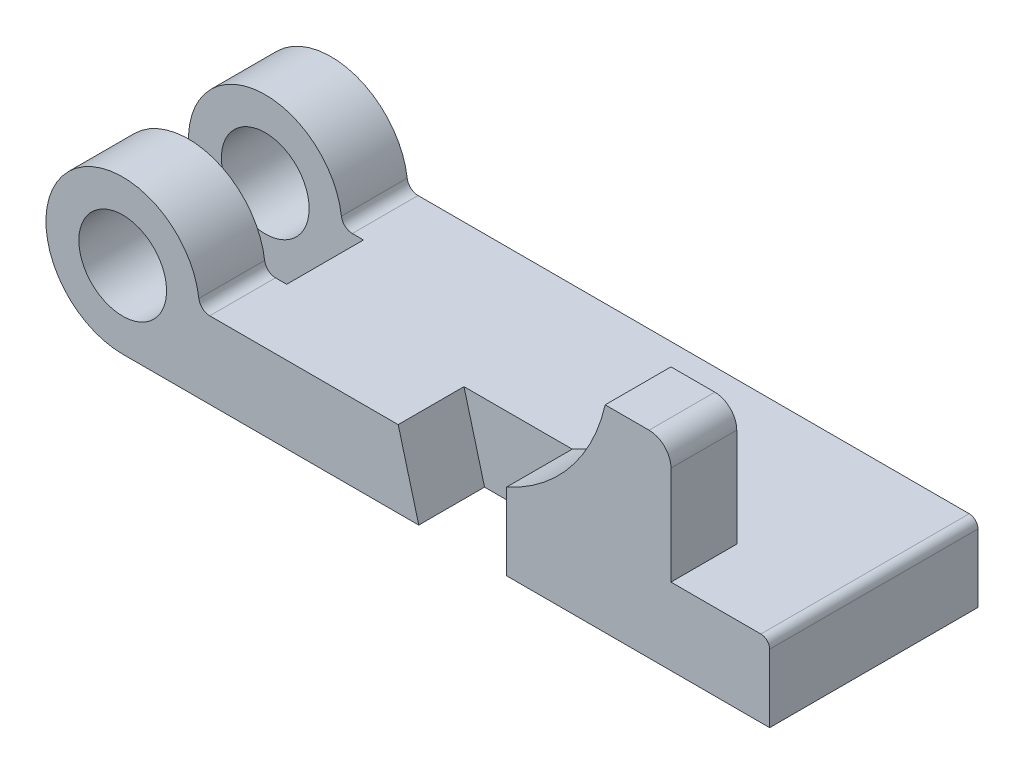
ISO-10303-21;
HEADER;
FILE_DESCRIPTION(('STEP AP214'),'2;1');
FILE_NAME('part.step','',(''),(''),'','','');
FILE_SCHEMA(('AUTOMOTIVE_DESIGN { 1 0 10303 214 1 1 1 1 }'));
ENDSEC;
DATA;
#1=APPLICATION_CONTEXT('core data for automotive mechanical design processes');
#2=APPLICATION_PROTOCOL_DEFINITION('international standard','automotive_design',2000,#1);
#3=PRODUCT_CONTEXT('',#1,'mechanical');
#4=PRODUCT('Part','Part','',(#3));
#5=PRODUCT_RELATED_PRODUCT_CATEGORY('part','',(#4));
#6=PRODUCT_DEFINITION_FORMATION('','',#4);
#7=PRODUCT_DEFINITION_CONTEXT('part definition',#1,'design');
#8=PRODUCT_DEFINITION('design','',#6,#7);
#9=PRODUCT_DEFINITION_SHAPE('','',#8);
#10=(LENGTH_UNIT() NAMED_UNIT(*) SI_UNIT(.MILLI.,.METRE.));
#11=(NAMED_UNIT(*) PLANE_ANGLE_UNIT() SI_UNIT($,.RADIAN.));
#12=(NAMED_UNIT(*) SI_UNIT($,.STERADIAN.) SOLID_ANGLE_UNIT());
#13=UNCERTAINTY_MEASURE_WITH_UNIT(LENGTH_MEASURE(1.E-05),#10,'distance_accuracy_value','');
#14=(GEOMETRIC_REPRESENTATION_CONTEXT(3) GLOBAL_UNCERTAINTY_ASSIGNED_CONTEXT((#13)) GLOBAL_UNIT_ASSIGNED_CONTEXT((#10,
#11,#12)) REPRESENTATION_CONTEXT('',''));
#15=CARTESIAN_POINT('',(0.,0.,0.));
#16=DIRECTION('',(0.,0.,1.));
#17=DIRECTION('',(1.,0.,0.));
#18=AXIS2_PLACEMENT_3D('',#15,#16,#17);
#19=CARTESIAN_POINT('',(0.,0.,11.1125));
#20=DIRECTION('',(0.,0.,1.));
#21=DIRECTION('',(1.,0.,0.));
#22=AXIS2_PLACEMENT_3D('',#19,#20,#21);
#23=PLANE('',#22);
#24=DIRECTION('',(1.,0.,0.));
#25=VECTOR('',#24,1.);
#26=CARTESIAN_POINT('',(0.,-22.225,11.1125));
#27=LINE('',#26,#25);
#28=CARTESIAN_POINT('',(85.725,-22.225,11.1125));
#29=VERTEX_POINT('',#28);
#30=CARTESIAN_POINT('',(111.125,-22.225,11.1125));
#31=VERTEX_POINT('',#30);
#32=EDGE_CURVE('E313',#29,#31,#27,.T.);
#33=ORIENTED_EDGE('',*,*,#32,.T.);
#34=DIRECTION('',(0.,-1.,0.));
#35=VECTOR('',#34,1.);
#36=CARTESIAN_POINT('',(111.125,0.,11.1125));
#37=LINE('',#36,#35);
#38=CARTESIAN_POINT('',(111.125,0.,11.1125));
#39=VERTEX_POINT('',#38);
#40=EDGE_CURVE('E53',#39,#31,#37,.T.);
#41=ORIENTED_EDGE('',*,*,#40,.F.);
#42=DIRECTION('',(-1.,0.,0.));
#43=VECTOR('',#42,1.);
#44=CARTESIAN_POINT('',(0.,0.,11.1125));
#45=LINE('',#44,#43);
#46=CARTESIAN_POINT('',(79.7698291982182,0.,11.1125));
#47=VERTEX_POINT('',#46);
#48=EDGE_CURVE('E315',#39,#47,#45,.T.);
#49=ORIENTED_EDGE('',*,*,#48,.T.);
#50=DIRECTION('',(-0.258819045102525,0.965925826289067,0.));
#51=VECTOR('',#50,1.);
#52=CARTESIAN_POINT('',(74.4262638697102,19.9424572995548,11.1125));
#53=LINE('',#52,#51);
#54=EDGE_CURVE('E305',#29,#47,#53,.T.);
#55=ORIENTED_EDGE('',*,*,#54,.F.);
#56=EDGE_LOOP('',(#33,#41,#49,#55));
#57=FACE_BOUND('',#56,.T.);
#58=ADVANCED_FACE('F35',(#57),#23,.T.);
#59=CARTESIAN_POINT('',(0.,-22.225,11.1125));
#60=DIRECTION('',(0.,1.,0.));
#61=DIRECTION('',(0.,0.,1.));
#62=AXIS2_PLACEMENT_3D('',#59,#60,#61);
#63=PLANE('',#62);
#64=DIRECTION('',(0.,0.,-1.));
#65=VECTOR('',#64,1.);
#66=CARTESIAN_POINT('',(41.275,-22.225,11.1125));
#67=LINE('',#66,#65);
#68=CARTESIAN_POINT('',(41.275,-22.225,11.1125));
#69=VERTEX_POINT('',#68);
#70=CARTESIAN_POINT('',(41.275,-22.225,-11.1125));
#71=VERTEX_POINT('',#70);
#72=EDGE_CURVE('E333',#69,#71,#67,.T.);
#73=ORIENTED_EDGE('',*,*,#72,.T.);
#74=DIRECTION('',(1.,0.,0.));
#75=VECTOR('',#74,1.);
#76=CARTESIAN_POINT('',(0.,-22.225,-11.1125));
#77=LINE('',#76,#75);
#78=CARTESIAN_POINT('',(0.,-22.225,-11.1125));
#79=VERTEX_POINT('',#78);
#80=EDGE_CURVE('E214',#79,#71,#77,.T.);
#81=ORIENTED_EDGE('',*,*,#80,.F.);
#82=DIRECTION('',(0.,0.,1.));
#83=VECTOR('',#82,1.);
#84=CARTESIAN_POINT('',(0.,-22.225,-30.1625));
#85=LINE('',#84,#83);
#86=CARTESIAN_POINT('',(0.,-22.225,-30.1625));
#87=VERTEX_POINT('',#86);
#88=EDGE_CURVE('E179',#87,#79,#85,.T.);
#89=ORIENTED_EDGE('',*,*,#88,.F.);
#90=DIRECTION('',(1.,0.,0.));
#91=VECTOR('',#90,1.);
#92=CARTESIAN_POINT('',(0.,-22.225,-30.1625));
#93=LINE('',#92,#91);
#94=CARTESIAN_POINT('',(187.325,-22.225,-30.1625));
#95=VERTEX_POINT('',#94);
#96=EDGE_CURVE('E197',#87,#95,#93,.T.);
#97=ORIENTED_EDGE('',*,*,#96,.T.);
#98=DIRECTION('',(0.,0.,-1.));
#99=VECTOR('',#98,1.);
#100=CARTESIAN_POINT('',(187.325,-22.225,11.1125));
#101=LINE('',#100,#99);
#102=CARTESIAN_POINT('',(187.325,-22.225,30.1625));
#103=VERTEX_POINT('',#102);
#104=EDGE_CURVE('E11',#103,#95,#101,.T.);
#105=ORIENTED_EDGE('',*,*,#104,.F.);
#106=DIRECTION('',(1.,0.,0.));
#107=VECTOR('',#106,1.);
#108=CARTESIAN_POINT('',(0.,-22.225,30.1625));
#109=LINE('',#108,#107);
#110=CARTESIAN_POINT('',(111.125,-22.225,30.1625));
#111=VERTEX_POINT('',#110);
#112=EDGE_CURVE('E244',#111,#103,#109,.T.);
#113=ORIENTED_EDGE('',*,*,#112,.F.);
#114=DIRECTION('',(0.,0.,-1.));
#115=VECTOR('',#114,1.);
#116=CARTESIAN_POINT('',(111.125,-22.225,30.1625));
#117=LINE('',#116,#115);
#118=EDGE_CURVE('E247',#111,#31,#117,.T.);
#119=ORIENTED_EDGE('',*,*,#118,.T.);
#120=ORIENTED_EDGE('',*,*,#32,.F.);
#121=DIRECTION('',(0.,0.,-1.));
#122=VECTOR('',#121,1.);
#123=CARTESIAN_POINT('',(85.725,-22.225,30.1625));
#124=LINE('',#123,#122);
#125=CARTESIAN_POINT('',(85.725,-22.225,30.1625));
#126=VERTEX_POINT('',#125);
#127=EDGE_CURVE('E320',#126,#29,#124,.T.);
#128=ORIENTED_EDGE('',*,*,#127,.F.);
#129=DIRECTION('',(1.,0.,0.));
#130=VECTOR('',#129,1.);
#131=CARTESIAN_POINT('',(0.,-22.225,30.1625));
#132=LINE('',#131,#130);
#133=CARTESIAN_POINT('',(0.,-22.225,30.1625));
#134=VERTEX_POINT('',#133);
#135=EDGE_CURVE('E281',#134,#126,#132,.T.);
#136=ORIENTED_EDGE('',*,*,#135,.F.);
#137=DIRECTION('',(0.,0.,-1.));
#138=VECTOR('',#137,1.);
#139=CARTESIAN_POINT('',(0.,-22.225,30.1625));
#140=LINE('',#139,#138);
#141=CARTESIAN_POINT('',(0.,-22.225,11.1125));
#142=VERTEX_POINT('',#141);
#143=EDGE_CURVE('E327',#134,#142,#140,.T.);
#144=ORIENTED_EDGE('',*,*,#143,.T.);
#145=DIRECTION('',(1.,0.,0.));
#146=VECTOR('',#145,1.);
#147=CARTESIAN_POINT('',(0.,-22.225,11.1125));
#148=LINE('',#147,#146);
#149=EDGE_CURVE('E296',#142,#69,#148,.T.);
#150=ORIENTED_EDGE('',*,*,#149,.T.);
#151=EDGE_LOOP('',(#73,#81,#89,#97,#105,#113,#119,#120,#128,#136,#144,#150));
#152=FACE_BOUND('',#151,.T.);
#153=ADVANCED_FACE('F37',(#152),#63,.F.);
#154=CARTESIAN_POINT('',(187.325,0.,11.1125));
#155=DIRECTION('',(-1.,0.,0.));
#156=DIRECTION('',(0.,0.,1.));
#157=AXIS2_PLACEMENT_3D('',#154,#155,#156);
#158=PLANE('',#157);
#159=ORIENTED_EDGE('',*,*,#104,.T.);
#160=DIRECTION('',(0.,1.,0.));
#161=VECTOR('',#160,1.);
#162=CARTESIAN_POINT('',(187.325,0.,-30.1625));
#163=LINE('',#162,#161);
#164=CARTESIAN_POINT('',(187.325,-2.54000000000002,-30.1625));
#165=VERTEX_POINT('',#164);
#166=EDGE_CURVE('E199',#95,#165,#163,.T.);
#167=ORIENTED_EDGE('',*,*,#166,.T.);
#168=DIRECTION('',(0.,0.,-1.));
#169=VECTOR('',#168,1.);
#170=CARTESIAN_POINT('',(187.325,-2.54000000000002,11.1125));
#171=LINE('',#170,#169);
#172=CARTESIAN_POINT('',(187.325,-2.54000000000002,30.1625));
#173=VERTEX_POINT('',#172);
#174=EDGE_CURVE('E45',#173,#165,#171,.T.);
#175=ORIENTED_EDGE('',*,*,#174,.F.);
#176=DIRECTION('',(0.,1.,0.));
#177=VECTOR('',#176,1.);
#178=CARTESIAN_POINT('',(187.325,0.,30.1625));
#179=LINE('',#178,#177);
#180=EDGE_CURVE('E225',#103,#173,#179,.T.);
#181=ORIENTED_EDGE('',*,*,#180,.F.);
#182=EDGE_LOOP('',(#159,#167,#175,#181));
#183=FACE_BOUND('',#182,.T.);
#184=ADVANCED_FACE('F346',(#183),#158,.F.);
#185=CARTESIAN_POINT('',(184.785,-2.54,11.1125));
#186=DIRECTION('',(0.,0.,-1.));
#187=DIRECTION('',(-1.,0.,0.));
#188=AXIS2_PLACEMENT_3D('',#185,#186,#187);
#189=CYLINDRICAL_SURFACE('',#188,2.53999999999999);
#190=ORIENTED_EDGE('',*,*,#174,.T.);
#191=CARTESIAN_POINT('',(184.785,-2.54,-30.1625));
#192=DIRECTION('',(0.,0.,1.));
#193=DIRECTION('',(1.,0.,0.));
#194=AXIS2_PLACEMENT_3D('',#191,#192,#193);
#195=CIRCLE('',#194,2.53999999999999);
#196=CARTESIAN_POINT('',(184.785,0.,-30.1625));
#197=VERTEX_POINT('',#196);
#198=EDGE_CURVE('E204',#165,#197,#195,.T.);
#199=ORIENTED_EDGE('',*,*,#198,.T.);
#200=DIRECTION('',(0.,0.,-1.));
#201=VECTOR('',#200,1.);
#202=CARTESIAN_POINT('',(184.785,0.,11.1125));
#203=LINE('',#202,#201);
#204=CARTESIAN_POINT('',(184.785,0.,30.1625));
#205=VERTEX_POINT('',#204);
#206=EDGE_CURVE('E338',#205,#197,#203,.T.);
#207=ORIENTED_EDGE('',*,*,#206,.F.);
#208=CARTESIAN_POINT('',(184.785,-2.54,30.1625));
#209=DIRECTION('',(0.,0.,1.));
#210=DIRECTION('',(1.,0.,0.));
#211=AXIS2_PLACEMENT_3D('',#208,#209,#210);
#212=CIRCLE('',#211,2.53999999999999);
#213=EDGE_CURVE('E228',#173,#205,#212,.T.);
#214=ORIENTED_EDGE('',*,*,#213,.F.);
#215=EDGE_LOOP('',(#190,#199,#207,#214));
#216=FACE_BOUND('',#215,.T.);
#217=ADVANCED_FACE('F343',(#216),#189,.T.);
#218=CARTESIAN_POINT('',(0.,0.,11.1125));
#219=DIRECTION('',(0.,-1.,0.));
#220=DIRECTION('',(0.,0.,-1.));
#221=AXIS2_PLACEMENT_3D('',#218,#219,#220);
#222=PLANE('',#221);
#223=ORIENTED_EDGE('',*,*,#206,.T.);
#224=DIRECTION('',(1.,0.,0.));
#225=VECTOR('',#224,1.);
#226=CARTESIAN_POINT('',(0.,0.,-30.1625));
#227=LINE('',#226,#225);
#228=CARTESIAN_POINT('',(25.2007812378902,0.,-30.1625));
#229=VERTEX_POINT('',#228);
#230=EDGE_CURVE('E207',#229,#197,#227,.T.);
#231=ORIENTED_EDGE('',*,*,#230,.F.);
#232=DIRECTION('',(0.,0.,1.));
#233=VECTOR('',#232,1.);
#234=CARTESIAN_POINT('',(25.2007812378902,0.,-30.1625));
#235=LINE('',#234,#233);
#236=CARTESIAN_POINT('',(25.2007812378902,0.,-11.1125));
#237=VERTEX_POINT('',#236);
#238=EDGE_CURVE('E187',#229,#237,#235,.T.);
#239=ORIENTED_EDGE('',*,*,#238,.T.);
#240=DIRECTION('',(1.,0.,0.));
#241=VECTOR('',#240,1.);
#242=CARTESIAN_POINT('',(0.,0.,-11.1125));
#243=LINE('',#242,#241);
#244=CARTESIAN_POINT('',(28.4433902672606,0.,-11.1125));
#245=VERTEX_POINT('',#244);
#246=EDGE_CURVE('E221',#237,#245,#243,.T.);
#247=ORIENTED_EDGE('',*,*,#246,.T.);
#248=DIRECTION('',(0.,0.,-1.));
#249=VECTOR('',#248,1.);
#250=CARTESIAN_POINT('',(28.4433902672606,0.,11.1125));
#251=LINE('',#250,#249);
#252=CARTESIAN_POINT('',(28.4433902672606,0.,11.1125));
#253=VERTEX_POINT('',#252);
#254=EDGE_CURVE('E339',#253,#245,#251,.T.);
#255=ORIENTED_EDGE('',*,*,#254,.F.);
#256=DIRECTION('',(1.,0.,0.));
#257=VECTOR('',#256,1.);
#258=CARTESIAN_POINT('',(0.,0.,11.1125));
#259=LINE('',#258,#257);
#260=CARTESIAN_POINT('',(25.2007812378902,0.,11.1125));
#261=VERTEX_POINT('',#260);
#262=EDGE_CURVE('E306',#261,#253,#259,.T.);
#263=ORIENTED_EDGE('',*,*,#262,.F.);
#264=DIRECTION('',(0.,0.,-1.));
#265=VECTOR('',#264,1.);
#266=CARTESIAN_POINT('',(25.2007812378902,0.,30.1625));
#267=LINE('',#266,#265);
#268=CARTESIAN_POINT('',(25.2007812378902,0.,30.1625));
#269=VERTEX_POINT('',#268);
#270=EDGE_CURVE('E291',#269,#261,#267,.T.);
#271=ORIENTED_EDGE('',*,*,#270,.F.);
#272=DIRECTION('',(1.,0.,0.));
#273=VECTOR('',#272,1.);
#274=CARTESIAN_POINT('',(0.,0.,30.1625));
#275=LINE('',#274,#273);
#276=CARTESIAN_POINT('',(79.7698291982182,0.,30.1625));
#277=VERTEX_POINT('',#276);
#278=EDGE_CURVE('E285',#269,#277,#275,.T.);
#279=ORIENTED_EDGE('',*,*,#278,.T.);
#280=DIRECTION('',(0.,0.,-1.));
#281=VECTOR('',#280,1.);
#282=CARTESIAN_POINT('',(79.7698291982182,0.,30.1625));
#283=LINE('',#282,#281);
#284=EDGE_CURVE('E317',#277,#47,#283,.T.);
#285=ORIENTED_EDGE('',*,*,#284,.T.);
#286=ORIENTED_EDGE('',*,*,#48,.F.);
#287=CARTESIAN_POINT('',(158.75,0.,11.1125));
#288=VERTEX_POINT('',#287);
#289=EDGE_CURVE('E60',#288,#39,#45,.T.);
#290=ORIENTED_EDGE('',*,*,#289,.F.);
#291=DIRECTION('',(0.,0.,-1.));
#292=VECTOR('',#291,1.);
#293=CARTESIAN_POINT('',(158.75,0.,30.1625));
#294=LINE('',#293,#292);
#295=CARTESIAN_POINT('',(158.75,0.,30.1625));
#296=VERTEX_POINT('',#295);
#297=EDGE_CURVE('E272',#296,#288,#294,.T.);
#298=ORIENTED_EDGE('',*,*,#297,.F.);
#299=DIRECTION('',(-1.,0.,0.));
#300=VECTOR('',#299,1.);
#301=CARTESIAN_POINT('',(0.,0.,30.1625));
#302=LINE('',#301,#300);
#303=EDGE_CURVE('E231',#205,#296,#302,.T.);
#304=ORIENTED_EDGE('',*,*,#303,.F.);
#305=EDGE_LOOP('',(#223,#231,#239,#247,#255,#263,#271,#279,#285,#286,#290,#298,#304));
#306=FACE_BOUND('',#305,.T.);
#307=ADVANCED_FACE('F393',(#306),#222,.F.);
#308=CARTESIAN_POINT('',(21.3325427004455,12.3163492706014,11.1125));
#309=DIRECTION('',(0.86602540378444,0.499999999999998,0.));
#310=DIRECTION('',(-0.499999999999998,0.86602540378444,0.));
#311=AXIS2_PLACEMENT_3D('',#308,#309,#310);
#312=PLANE('',#311);
#313=DIRECTION('',(0.499999999999998,-0.86602540378444,0.));
#314=VECTOR('',#313,1.);
#315=CARTESIAN_POINT('',(21.3325427004455,12.3163492706014,-11.1125));
#316=LINE('',#315,#314);
#317=EDGE_CURVE('E39',#245,#71,#316,.T.);
#318=ORIENTED_EDGE('',*,*,#317,.T.);
#319=ORIENTED_EDGE('',*,*,#72,.F.);
#320=DIRECTION('',(0.499999999999998,-0.86602540378444,0.));
#321=VECTOR('',#320,1.);
#322=CARTESIAN_POINT('',(21.3325427004455,12.3163492706014,11.1125));
#323=LINE('',#322,#321);
#324=EDGE_CURVE('E330',#253,#69,#323,.T.);
#325=ORIENTED_EDGE('',*,*,#324,.F.);
#326=ORIENTED_EDGE('',*,*,#254,.T.);
#327=EDGE_LOOP('',(#318,#319,#325,#326));
#328=FACE_BOUND('',#327,.T.);
#329=ADVANCED_FACE('F386',(#328),#312,.F.);
#330=CARTESIAN_POINT('',(0.,0.,11.1125));
#331=DIRECTION('',(0.,0.,1.));
#332=DIRECTION('',(1.,0.,0.));
#333=AXIS2_PLACEMENT_3D('',#330,#331,#332);
#334=PLANE('',#333);
#335=CARTESIAN_POINT('',(0.,0.,11.1125));
#336=DIRECTION('',(0.,0.,1.));
#337=DIRECTION('',(1.,0.,0.));
#338=AXIS2_PLACEMENT_3D('',#335,#336,#337);
#339=CIRCLE('',#338,12.7);
#340=CARTESIAN_POINT('',(-12.7,0.,11.1125));
#341=VERTEX_POINT('',#340);
#342=EDGE_CURVE('E279',#341,#341,#339,.T.);
#343=ORIENTED_EDGE('',*,*,#342,.T.);
#344=EDGE_LOOP('',(#343));
#345=FACE_BOUND('',#344,.T.);
#346=ORIENTED_EDGE('',*,*,#262,.T.);
#347=ORIENTED_EDGE('',*,*,#324,.T.);
#348=ORIENTED_EDGE('',*,*,#149,.F.);
#349=CARTESIAN_POINT('',(0.,0.,11.1125));
#350=DIRECTION('',(0.,0.,1.));
#351=DIRECTION('',(1.,0.,0.));
#352=AXIS2_PLACEMENT_3D('',#349,#350,#351);
#353=CIRCLE('',#352,22.225);
#354=CARTESIAN_POINT('',(22.0506835831539,2.778125,11.1125));
#355=VERTEX_POINT('',#354);
#356=EDGE_CURVE('E294',#355,#142,#353,.T.);
#357=ORIENTED_EDGE('',*,*,#356,.F.);
#358=CARTESIAN_POINT('',(25.2007812378902,3.175,11.1125));
#359=DIRECTION('',(0.,0.,1.));
#360=DIRECTION('',(1.,0.,0.));
#361=AXIS2_PLACEMENT_3D('',#358,#359,#360);
#362=CIRCLE('',#361,3.175);
#363=EDGE_CURVE('E274',#355,#261,#362,.T.);
#364=ORIENTED_EDGE('',*,*,#363,.T.);
#365=EDGE_LOOP('',(#346,#347,#348,#357,#364));
#366=FACE_BOUND('',#365,.T.);
#367=ADVANCED_FACE('F379',(#345,#366),#334,.F.);
#368=CARTESIAN_POINT('',(25.2007812378902,3.175,30.1625));
#369=DIRECTION('',(0.,0.,-1.));
#370=DIRECTION('',(-1.,0.,0.));
#371=AXIS2_PLACEMENT_3D('',#368,#369,#370);
#372=CYLINDRICAL_SURFACE('',#371,3.175);
#373=ORIENTED_EDGE('',*,*,#363,.F.);
#374=DIRECTION('',(0.,0.,-1.));
#375=VECTOR('',#374,1.);
#376=CARTESIAN_POINT('',(22.0506835831539,2.778125,30.1625));
#377=LINE('',#376,#375);
#378=CARTESIAN_POINT('',(22.0506835831539,2.778125,30.1625));
#379=VERTEX_POINT('',#378);
#380=EDGE_CURVE('E374',#379,#355,#377,.T.);
#381=ORIENTED_EDGE('',*,*,#380,.F.);
#382=CARTESIAN_POINT('',(25.2007812378902,3.175,30.1625));
#383=DIRECTION('',(0.,0.,1.));
#384=DIRECTION('',(1.,0.,0.));
#385=AXIS2_PLACEMENT_3D('',#382,#383,#384);
#386=CIRCLE('',#385,3.175);
#387=EDGE_CURVE('E275',#379,#269,#386,.T.);
#388=ORIENTED_EDGE('',*,*,#387,.T.);
#389=ORIENTED_EDGE('',*,*,#270,.T.);
#390=EDGE_LOOP('',(#373,#381,#388,#389));
#391=FACE_BOUND('',#390,.T.);
#392=ADVANCED_FACE('F396',(#391),#372,.F.);
#393=CARTESIAN_POINT('',(0.,0.,30.1625));
#394=DIRECTION('',(0.,0.,-1.));
#395=DIRECTION('',(-1.,0.,0.));
#396=AXIS2_PLACEMENT_3D('',#393,#394,#395);
#397=CYLINDRICAL_SURFACE('',#396,22.225);
#398=ORIENTED_EDGE('',*,*,#356,.T.);
#399=ORIENTED_EDGE('',*,*,#143,.F.);
#400=CARTESIAN_POINT('',(0.,0.,30.1625));
#401=DIRECTION('',(0.,0.,1.));
#402=DIRECTION('',(1.,0.,0.));
#403=AXIS2_PLACEMENT_3D('',#400,#401,#402);
#404=CIRCLE('',#403,22.225);
#405=EDGE_CURVE('E278',#379,#134,#404,.T.);
#406=ORIENTED_EDGE('',*,*,#405,.F.);
#407=ORIENTED_EDGE('',*,*,#380,.T.);
#408=EDGE_LOOP('',(#398,#399,#406,#407));
#409=FACE_BOUND('',#408,.T.);
#410=ADVANCED_FACE('F397',(#409),#397,.T.);
#411=CARTESIAN_POINT('',(74.4262638697102,19.9424572995548,30.1625));
#412=DIRECTION('',(-0.965925826289067,-0.258819045102525,0.));
#413=DIRECTION('',(0.258819045102525,-0.965925826289067,0.));
#414=AXIS2_PLACEMENT_3D('',#411,#412,#413);
#415=PLANE('',#414);
#416=ORIENTED_EDGE('',*,*,#54,.T.);
#417=ORIENTED_EDGE('',*,*,#284,.F.);
#418=DIRECTION('',(-0.258819045102525,0.965925826289067,0.));
#419=VECTOR('',#418,1.);
#420=CARTESIAN_POINT('',(74.4262638697102,19.9424572995548,30.1625));
#421=LINE('',#420,#419);
#422=EDGE_CURVE('E283',#126,#277,#421,.T.);
#423=ORIENTED_EDGE('',*,*,#422,.F.);
#424=ORIENTED_EDGE('',*,*,#127,.T.);
#425=EDGE_LOOP('',(#416,#417,#423,#424));
#426=FACE_BOUND('',#425,.T.);
#427=ADVANCED_FACE('F362',(#426),#415,.F.);
#428=CARTESIAN_POINT('',(0.,0.,30.1625));
#429=DIRECTION('',(0.,0.,-1.));
#430=DIRECTION('',(-1.,0.,0.));
#431=AXIS2_PLACEMENT_3D('',#428,#429,#430);
#432=CYLINDRICAL_SURFACE('',#431,12.7);
#433=CARTESIAN_POINT('',(0.,0.,30.1625));
#434=DIRECTION('',(0.,0.,1.));
#435=DIRECTION('',(1.,0.,0.));
#436=AXIS2_PLACEMENT_3D('',#433,#434,#435);
#437=CIRCLE('',#436,12.7);
#438=CARTESIAN_POINT('',(-12.7,0.,30.1625));
#439=VERTEX_POINT('',#438);
#440=EDGE_CURVE('E288',#439,#439,#437,.T.);
#441=CARTESIAN_POINT('',(-12.7,0.,30.1625));
#442=CARTESIAN_POINT('',(-12.7,0.,29.9640625));
#443=CARTESIAN_POINT('',(-12.7,0.,29.765625));
#444=CARTESIAN_POINT('',(-12.7,0.,29.36875));
#445=CARTESIAN_POINT('',(-12.7,0.,29.1703125));
#446=CARTESIAN_POINT('',(-12.7,0.,28.7734375));
#447=CARTESIAN_POINT('',(-12.7,0.,28.575));
#448=CARTESIAN_POINT('',(-12.7,0.,28.178125));
#449=CARTESIAN_POINT('',(-12.7,0.,27.9796875));
#450=CARTESIAN_POINT('',(-12.7,0.,27.5828125));
#451=CARTESIAN_POINT('',(-12.7,0.,27.384375));
#452=CARTESIAN_POINT('',(-12.7,0.,26.9875));
#453=CARTESIAN_POINT('',(-12.7,0.,26.7890625));
#454=CARTESIAN_POINT('',(-12.7,0.,26.3921875));
#455=CARTESIAN_POINT('',(-12.7,0.,26.19375));
#456=CARTESIAN_POINT('',(-12.7,0.,25.796875));
#457=CARTESIAN_POINT('',(-12.7,0.,25.5984375));
#458=CARTESIAN_POINT('',(-12.7,0.,25.2015625));
#459=CARTESIAN_POINT('',(-12.7,0.,25.003125));
#460=CARTESIAN_POINT('',(-12.7,0.,24.60625));
#461=CARTESIAN_POINT('',(-12.7,0.,24.4078125));
#462=CARTESIAN_POINT('',(-12.7,0.,24.0109375));
#463=CARTESIAN_POINT('',(-12.7,0.,23.8125));
#464=CARTESIAN_POINT('',(-12.7,0.,23.415625));
#465=CARTESIAN_POINT('',(-12.7,0.,23.2171875));
#466=CARTESIAN_POINT('',(-12.7,0.,22.8203125));
#467=CARTESIAN_POINT('',(-12.7,0.,22.621875));
#468=CARTESIAN_POINT('',(-12.7,0.,22.225));
#469=CARTESIAN_POINT('',(-12.7,0.,22.0265625));
#470=CARTESIAN_POINT('',(-12.7,0.,21.6296875));
#471=CARTESIAN_POINT('',(-12.7,0.,21.43125));
#472=CARTESIAN_POINT('',(-12.7,0.,21.034375));
#473=CARTESIAN_POINT('',(-12.7,0.,20.8359375));
#474=CARTESIAN_POINT('',(-12.7,0.,20.4390625));
#475=CARTESIAN_POINT('',(-12.7,0.,20.240625));
#476=CARTESIAN_POINT('',(-12.7,0.,19.84375));
#477=CARTESIAN_POINT('',(-12.7,0.,19.6453125));
#478=CARTESIAN_POINT('',(-12.7,0.,19.2484375));
#479=CARTESIAN_POINT('',(-12.7,0.,19.05));
#480=CARTESIAN_POINT('',(-12.7,0.,18.653125));
#481=CARTESIAN_POINT('',(-12.7,0.,18.4546875));
#482=CARTESIAN_POINT('',(-12.7,0.,18.0578125));
#483=CARTESIAN_POINT('',(-12.7,0.,17.859375));
#484=CARTESIAN_POINT('',(-12.7,0.,17.4625));
#485=CARTESIAN_POINT('',(-12.7,0.,17.2640625));
#486=CARTESIAN_POINT('',(-12.7,0.,16.8671875));
#487=CARTESIAN_POINT('',(-12.7,0.,16.66875));
#488=CARTESIAN_POINT('',(-12.7,0.,16.271875));
#489=CARTESIAN_POINT('',(-12.7,0.,16.0734375));
#490=CARTESIAN_POINT('',(-12.7,0.,15.6765625));
#491=CARTESIAN_POINT('',(-12.7,0.,15.478125));
#492=CARTESIAN_POINT('',(-12.7,0.,15.08125));
#493=CARTESIAN_POINT('',(-12.7,0.,14.8828125));
#494=CARTESIAN_POINT('',(-12.7,0.,14.4859375));
#495=CARTESIAN_POINT('',(-12.7,0.,14.2875));
#496=CARTESIAN_POINT('',(-12.7,0.,13.890625));
#497=CARTESIAN_POINT('',(-12.7,0.,13.6921875));
#498=CARTESIAN_POINT('',(-12.7,0.,13.2953125));
#499=CARTESIAN_POINT('',(-12.7,0.,13.096875));
#500=CARTESIAN_POINT('',(-12.7,0.,12.7));
#501=CARTESIAN_POINT('',(-12.7,0.,12.5015625));
#502=CARTESIAN_POINT('',(-12.7,0.,12.1046875));
#503=CARTESIAN_POINT('',(-12.7,0.,11.90625));
#504=CARTESIAN_POINT('',(-12.7,0.,11.509375));
#505=CARTESIAN_POINT('',(-12.7,0.,11.3109375));
#506=CARTESIAN_POINT('',(-12.7,0.,11.1125));
#507=B_SPLINE_CURVE_WITH_KNOTS('',3,(#441,#442,#443,#444,#445,#446,#447,#448,#449,#450,#451,
#452,#453,#454,#455,#456,#457,#458,#459,#460,#461,#462,#463,#464,#465,#466,#467,#468,#469,#470,
#471,#472,#473,#474,#475,#476,#477,#478,#479,#480,#481,#482,#483,#484,#485,#486,#487,#488,#489,
#490,#491,#492,#493,#494,#495,#496,#497,#498,#499,#500,#501,#502,#503,#504,#505,#506),
.UNSPECIFIED.,.F.,.F.,(4,2,2,2,2,2,2,2,2,2,2,2,2,2,2,2,2,2,2,2,2,2,2,2,2,2,2,2,2,2,2,2,4),(0.,
0.595312499999997,1.190625,1.7859375,2.38125,2.9765625,3.571875,4.1671875,4.7625,5.3578125,
5.953125,6.5484375,7.14375,7.7390625,8.33437499999999,8.92968749999999,9.525,10.1203125,
10.715625,11.3109375,11.90625,12.5015625,13.096875,13.6921875,14.2875,14.8828125,15.478125,
16.0734375,16.66875,17.2640625,17.859375,18.4546875,19.05),.UNSPECIFIED.);
#508=EDGE_CURVE('BSEAM404',#439,#341,#507,.T.);
#509=ORIENTED_EDGE('',*,*,#440,.T.);
#510=ORIENTED_EDGE('',*,*,#342,.F.);
#511=ORIENTED_EDGE('',*,*,#508,.T.);
#512=ORIENTED_EDGE('',*,*,#508,.F.);
#513=EDGE_LOOP('',(#509,#511,#510,#512));
#514=FACE_BOUND('',#513,.T.);
#515=ADVANCED_FACE('F404',(#514),#432,.F.);
#516=CARTESIAN_POINT('',(0.,0.,30.1625));
#517=DIRECTION('',(0.,0.,1.));
#518=DIRECTION('',(1.,0.,0.));
#519=AXIS2_PLACEMENT_3D('',#516,#517,#518);
#520=PLANE('',#519);
#521=ORIENTED_EDGE('',*,*,#387,.F.);
#522=ORIENTED_EDGE('',*,*,#405,.T.);
#523=ORIENTED_EDGE('',*,*,#135,.T.);
#524=ORIENTED_EDGE('',*,*,#422,.T.);
#525=ORIENTED_EDGE('',*,*,#278,.F.);
#526=EDGE_LOOP('',(#521,#522,#523,#524,#525));
#527=FACE_BOUND('',#526,.T.);
#528=ORIENTED_EDGE('',*,*,#440,.F.);
#529=EDGE_LOOP('',(#528));
#530=FACE_BOUND('',#529,.T.);
#531=ADVANCED_FACE('F367',(#527,#530),#520,.T.);
#532=CARTESIAN_POINT('',(0.,0.,11.1125));
#533=DIRECTION('',(0.,0.,1.));
#534=DIRECTION('',(1.,0.,0.));
#535=AXIS2_PLACEMENT_3D('',#532,#533,#534);
#536=PLANE('',#535);
#537=DIRECTION('',(0.,1.,0.));
#538=VECTOR('',#537,1.);
#539=CARTESIAN_POINT('',(158.75,0.,11.1125));
#540=LINE('',#539,#538);
#541=CARTESIAN_POINT('',(158.75,28.575,11.1125));
#542=VERTEX_POINT('',#541);
#543=EDGE_CURVE('E248',#288,#542,#540,.T.);
#544=ORIENTED_EDGE('',*,*,#543,.F.);
#545=ORIENTED_EDGE('',*,*,#289,.T.);
#546=CARTESIAN_POINT('',(90.1862313267344,46.2839925508536,11.1125));
#547=DIRECTION('',(0.,0.,1.));
#548=DIRECTION('',(1.,0.,0.));
#549=AXIS2_PLACEMENT_3D('',#546,#547,#548);
#550=CIRCLE('',#549,50.8);
#551=CARTESIAN_POINT('',(139.7,34.925,11.1125));
#552=VERTEX_POINT('',#551);
#553=EDGE_CURVE('E255',#39,#552,#550,.T.);
#554=ORIENTED_EDGE('',*,*,#553,.T.);
#555=DIRECTION('',(-1.,0.,0.));
#556=VECTOR('',#555,1.);
#557=CARTESIAN_POINT('',(0.,34.925,11.1125));
#558=LINE('',#557,#556);
#559=CARTESIAN_POINT('',(152.4,34.925,11.1125));
#560=VERTEX_POINT('',#559);
#561=EDGE_CURVE('E252',#560,#552,#558,.T.);
#562=ORIENTED_EDGE('',*,*,#561,.F.);
#563=CARTESIAN_POINT('',(152.4,28.575,11.1125));
#564=DIRECTION('',(0.,0.,1.));
#565=DIRECTION('',(1.,0.,0.));
#566=AXIS2_PLACEMENT_3D('',#563,#564,#565);
#567=CIRCLE('',#566,6.35);
#568=EDGE_CURVE('E250',#542,#560,#567,.T.);
#569=ORIENTED_EDGE('',*,*,#568,.F.);
#570=EDGE_LOOP('',(#544,#545,#554,#562,#569));
#571=FACE_BOUND('',#570,.T.);
#572=ADVANCED_FACE('F476',(#571),#536,.F.);
#573=CARTESIAN_POINT('',(158.75,0.,30.1625));
#574=DIRECTION('',(-1.,0.,0.));
#575=DIRECTION('',(0.,0.,1.));
#576=AXIS2_PLACEMENT_3D('',#573,#574,#575);
#577=PLANE('',#576);
#578=ORIENTED_EDGE('',*,*,#543,.T.);
#579=DIRECTION('',(0.,0.,-1.));
#580=VECTOR('',#579,1.);
#581=CARTESIAN_POINT('',(158.75,28.575,30.1625));
#582=LINE('',#581,#580);
#583=CARTESIAN_POINT('',(158.75,28.575,30.1625));
#584=VERTEX_POINT('',#583);
#585=EDGE_CURVE('E269',#584,#542,#582,.T.);
#586=ORIENTED_EDGE('',*,*,#585,.F.);
#587=DIRECTION('',(0.,1.,0.));
#588=VECTOR('',#587,1.);
#589=CARTESIAN_POINT('',(158.75,0.,30.1625));
#590=LINE('',#589,#588);
#591=EDGE_CURVE('E233',#296,#584,#590,.T.);
#592=ORIENTED_EDGE('',*,*,#591,.F.);
#593=ORIENTED_EDGE('',*,*,#297,.T.);
#594=EDGE_LOOP('',(#578,#586,#592,#593));
#595=FACE_BOUND('',#594,.T.);
#596=ADVANCED_FACE('F487',(#595),#577,.F.);
#597=CARTESIAN_POINT('',(152.4,28.575,30.1625));
#598=DIRECTION('',(0.,0.,-1.));
#599=DIRECTION('',(-1.,0.,0.));
#600=AXIS2_PLACEMENT_3D('',#597,#598,#599);
#601=CYLINDRICAL_SURFACE('',#600,6.35);
#602=ORIENTED_EDGE('',*,*,#568,.T.);
#603=DIRECTION('',(0.,0.,-1.));
#604=VECTOR('',#603,1.);
#605=CARTESIAN_POINT('',(152.4,34.925,30.1625));
#606=LINE('',#605,#604);
#607=CARTESIAN_POINT('',(152.4,34.925,30.1625));
#608=VERTEX_POINT('',#607);
#609=EDGE_CURVE('E266',#608,#560,#606,.T.);
#610=ORIENTED_EDGE('',*,*,#609,.F.);
#611=CARTESIAN_POINT('',(152.4,28.575,30.1625));
#612=DIRECTION('',(0.,0.,1.));
#613=DIRECTION('',(1.,0.,0.));
#614=AXIS2_PLACEMENT_3D('',#611,#612,#613);
#615=CIRCLE('',#614,6.35);
#616=EDGE_CURVE('E235',#584,#608,#615,.T.);
#617=ORIENTED_EDGE('',*,*,#616,.F.);
#618=ORIENTED_EDGE('',*,*,#585,.T.);
#619=EDGE_LOOP('',(#602,#610,#617,#618));
#620=FACE_BOUND('',#619,.T.);
#621=ADVANCED_FACE('F497',(#620),#601,.T.);
#622=CARTESIAN_POINT('',(0.,34.925,30.1625));
#623=DIRECTION('',(0.,-1.,0.));
#624=DIRECTION('',(0.,0.,-1.));
#625=AXIS2_PLACEMENT_3D('',#622,#623,#624);
#626=PLANE('',#625);
#627=ORIENTED_EDGE('',*,*,#561,.T.);
#628=DIRECTION('',(0.,0.,-1.));
#629=VECTOR('',#628,1.);
#630=CARTESIAN_POINT('',(139.7,34.925,30.1625));
#631=LINE('',#630,#629);
#632=CARTESIAN_POINT('',(139.7,34.925,30.1625));
#633=VERTEX_POINT('',#632);
#634=EDGE_CURVE('E264',#633,#552,#631,.T.);
#635=ORIENTED_EDGE('',*,*,#634,.F.);
#636=DIRECTION('',(-1.,0.,0.));
#637=VECTOR('',#636,1.);
#638=CARTESIAN_POINT('',(0.,34.925,30.1625));
#639=LINE('',#638,#637);
#640=EDGE_CURVE('E237',#608,#633,#639,.T.);
#641=ORIENTED_EDGE('',*,*,#640,.F.);
#642=ORIENTED_EDGE('',*,*,#609,.T.);
#643=EDGE_LOOP('',(#627,#635,#641,#642));
#644=FACE_BOUND('',#643,.T.);
#645=ADVANCED_FACE('F507',(#644),#626,.F.);
#646=CARTESIAN_POINT('',(90.1862313267344,46.2839925508536,30.1625));
#647=DIRECTION('',(0.,0.,-1.));
#648=DIRECTION('',(-1.,0.,0.));
#649=AXIS2_PLACEMENT_3D('',#646,#647,#648);
#650=CYLINDRICAL_SURFACE('',#649,50.8);
#651=ORIENTED_EDGE('',*,*,#553,.F.);
#652=DIRECTION('',(0.,0.,-1.));
#653=VECTOR('',#652,1.);
#654=CARTESIAN_POINT('',(111.125,0.,30.1625));
#655=LINE('',#654,#653);
#656=CARTESIAN_POINT('',(111.125,0.,30.1625));
#657=VERTEX_POINT('',#656);
#658=EDGE_CURVE('E261',#657,#39,#655,.T.);
#659=ORIENTED_EDGE('',*,*,#658,.F.);
#660=CARTESIAN_POINT('',(90.1862313267344,46.2839925508536,30.1625));
#661=DIRECTION('',(0.,0.,1.));
#662=DIRECTION('',(1.,0.,0.));
#663=AXIS2_PLACEMENT_3D('',#660,#661,#662);
#664=CIRCLE('',#663,50.8);
#665=EDGE_CURVE('E239',#657,#633,#664,.T.);
#666=ORIENTED_EDGE('',*,*,#665,.T.);
#667=ORIENTED_EDGE('',*,*,#634,.T.);
#668=EDGE_LOOP('',(#651,#659,#666,#667));
#669=FACE_BOUND('',#668,.T.);
#670=ADVANCED_FACE('F517',(#669),#650,.F.);
#671=CARTESIAN_POINT('',(111.125,0.,30.1625));
#672=DIRECTION('',(1.,0.,0.));
#673=DIRECTION('',(0.,0.,-1.));
#674=AXIS2_PLACEMENT_3D('',#671,#672,#673);
#675=PLANE('',#674);
#676=ORIENTED_EDGE('',*,*,#40,.T.);
#677=ORIENTED_EDGE('',*,*,#118,.F.);
#678=DIRECTION('',(0.,-1.,0.));
#679=VECTOR('',#678,1.);
#680=CARTESIAN_POINT('',(111.125,0.,30.1625));
#681=LINE('',#680,#679);
#682=EDGE_CURVE('E242',#657,#111,#681,.T.);
#683=ORIENTED_EDGE('',*,*,#682,.F.);
#684=ORIENTED_EDGE('',*,*,#658,.T.);
#685=EDGE_LOOP('',(#676,#677,#683,#684));
#686=FACE_BOUND('',#685,.T.);
#687=ADVANCED_FACE('F356',(#686),#675,.F.);
#688=CARTESIAN_POINT('',(0.,0.,30.1625));
#689=DIRECTION('',(0.,0.,1.));
#690=DIRECTION('',(1.,0.,0.));
#691=AXIS2_PLACEMENT_3D('',#688,#689,#690);
#692=PLANE('',#691);
#693=ORIENTED_EDGE('',*,*,#180,.T.);
#694=ORIENTED_EDGE('',*,*,#213,.T.);
#695=ORIENTED_EDGE('',*,*,#303,.T.);
#696=ORIENTED_EDGE('',*,*,#591,.T.);
#697=ORIENTED_EDGE('',*,*,#616,.T.);
#698=ORIENTED_EDGE('',*,*,#640,.T.);
#699=ORIENTED_EDGE('',*,*,#665,.F.);
#700=ORIENTED_EDGE('',*,*,#682,.T.);
#701=ORIENTED_EDGE('',*,*,#112,.T.);
#702=EDGE_LOOP('',(#693,#694,#695,#696,#697,#698,#699,#700,#701));
#703=FACE_BOUND('',#702,.T.);
#704=ADVANCED_FACE('F351',(#703),#692,.T.);
#705=CARTESIAN_POINT('',(0.,0.,-11.1125));
#706=DIRECTION('',(0.,0.,1.));
#707=DIRECTION('',(1.,0.,0.));
#708=AXIS2_PLACEMENT_3D('',#705,#706,#707);
#709=PLANE('',#708);
#710=CARTESIAN_POINT('',(0.,0.,-11.1125));
#711=DIRECTION('',(0.,0.,1.));
#712=DIRECTION('',(1.,0.,0.));
#713=AXIS2_PLACEMENT_3D('',#710,#711,#712);
#714=CIRCLE('',#713,12.7);
#715=CARTESIAN_POINT('',(12.7,0.,-11.1125));
#716=VERTEX_POINT('',#715);
#717=EDGE_CURVE('E190',#716,#716,#714,.T.);
#718=ORIENTED_EDGE('',*,*,#717,.F.);
#719=EDGE_LOOP('',(#718));
#720=FACE_BOUND('',#719,.T.);
#721=ORIENTED_EDGE('',*,*,#317,.F.);
#722=ORIENTED_EDGE('',*,*,#246,.F.);
#723=CARTESIAN_POINT('',(25.2007812378902,3.175,-11.1125));
#724=DIRECTION('',(0.,0.,1.));
#725=DIRECTION('',(1.,0.,0.));
#726=AXIS2_PLACEMENT_3D('',#723,#724,#725);
#727=CIRCLE('',#726,3.175);
#728=CARTESIAN_POINT('',(22.0506835831539,2.778125,-11.1125));
#729=VERTEX_POINT('',#728);
#730=EDGE_CURVE('E211',#729,#237,#727,.T.);
#731=ORIENTED_EDGE('',*,*,#730,.F.);
#732=CARTESIAN_POINT('',(0.,0.,-11.1125));
#733=DIRECTION('',(0.,0.,1.));
#734=DIRECTION('',(1.,0.,0.));
#735=AXIS2_PLACEMENT_3D('',#732,#733,#734);
#736=CIRCLE('',#735,22.225);
#737=EDGE_CURVE('E175',#729,#79,#736,.T.);
#738=ORIENTED_EDGE('',*,*,#737,.T.);
#739=ORIENTED_EDGE('',*,*,#80,.T.);
#740=EDGE_LOOP('',(#721,#722,#731,#738,#739));
#741=FACE_BOUND('',#740,.T.);
#742=ADVANCED_FACE('F544',(#720,#741),#709,.T.);
#743=CARTESIAN_POINT('',(25.2007812378902,3.175,-30.1625));
#744=DIRECTION('',(0.,0.,1.));
#745=DIRECTION('',(1.,0.,0.));
#746=AXIS2_PLACEMENT_3D('',#743,#744,#745);
#747=CYLINDRICAL_SURFACE('',#746,3.175);
#748=ORIENTED_EDGE('',*,*,#730,.T.);
#749=ORIENTED_EDGE('',*,*,#238,.F.);
#750=CARTESIAN_POINT('',(25.2007812378902,3.175,-30.1625));
#751=DIRECTION('',(0.,0.,1.));
#752=DIRECTION('',(1.,0.,0.));
#753=AXIS2_PLACEMENT_3D('',#750,#751,#752);
#754=CIRCLE('',#753,3.175);
#755=CARTESIAN_POINT('',(22.0506835831539,2.778125,-30.1625));
#756=VERTEX_POINT('',#755);
#757=EDGE_CURVE('E184',#756,#229,#754,.T.);
#758=ORIENTED_EDGE('',*,*,#757,.F.);
#759=DIRECTION('',(0.,0.,1.));
#760=VECTOR('',#759,1.);
#761=CARTESIAN_POINT('',(22.0506835831539,2.778125,-30.1625));
#762=LINE('',#761,#760);
#763=EDGE_CURVE('E169',#756,#729,#762,.T.);
#764=ORIENTED_EDGE('',*,*,#763,.T.);
#765=EDGE_LOOP('',(#748,#749,#758,#764));
#766=FACE_BOUND('',#765,.T.);
#767=ADVANCED_FACE('F185',(#766),#747,.F.);
#768=CARTESIAN_POINT('',(0.,0.,-30.1625));
#769=DIRECTION('',(0.,0.,1.));
#770=DIRECTION('',(1.,0.,0.));
#771=AXIS2_PLACEMENT_3D('',#768,#769,#770);
#772=CYLINDRICAL_SURFACE('',#771,22.225);
#773=ORIENTED_EDGE('',*,*,#737,.F.);
#774=ORIENTED_EDGE('',*,*,#763,.F.);
#775=CARTESIAN_POINT('',(0.,0.,-30.1625));
#776=DIRECTION('',(0.,0.,1.));
#777=DIRECTION('',(1.,0.,0.));
#778=AXIS2_PLACEMENT_3D('',#775,#776,#777);
#779=CIRCLE('',#778,22.225);
#780=EDGE_CURVE('E173',#756,#87,#779,.T.);
#781=ORIENTED_EDGE('',*,*,#780,.T.);
#782=ORIENTED_EDGE('',*,*,#88,.T.);
#783=EDGE_LOOP('',(#773,#774,#781,#782));
#784=FACE_BOUND('',#783,.T.);
#785=ADVANCED_FACE('F171',(#784),#772,.T.);
#786=CARTESIAN_POINT('',(0.,0.,-30.1625));
#787=DIRECTION('',(0.,0.,1.));
#788=DIRECTION('',(1.,0.,0.));
#789=AXIS2_PLACEMENT_3D('',#786,#787,#788);
#790=CYLINDRICAL_SURFACE('',#789,12.7);
#791=CARTESIAN_POINT('',(0.,0.,-30.1625));
#792=DIRECTION('',(0.,0.,1.));
#793=DIRECTION('',(1.,0.,0.));
#794=AXIS2_PLACEMENT_3D('',#791,#792,#793);
#795=CIRCLE('',#794,12.7);
#796=CARTESIAN_POINT('',(12.7,0.,-30.1625));
#797=VERTEX_POINT('',#796);
#798=EDGE_CURVE('E180',#797,#797,#795,.T.);
#799=CARTESIAN_POINT('',(12.7,0.,-30.1625));
#800=CARTESIAN_POINT('',(12.7,0.,-29.9640625));
#801=CARTESIAN_POINT('',(12.7,0.,-29.765625));
#802=CARTESIAN_POINT('',(12.7,0.,-29.36875));
#803=CARTESIAN_POINT('',(12.7,0.,-29.1703125));
#804=CARTESIAN_POINT('',(12.7,0.,-28.7734375));
#805=CARTESIAN_POINT('',(12.7,0.,-28.575));
#806=CARTESIAN_POINT('',(12.7,0.,-28.178125));
#807=CARTESIAN_POINT('',(12.7,0.,-27.9796875));
#808=CARTESIAN_POINT('',(12.7,0.,-27.5828125));
#809=CARTESIAN_POINT('',(12.7,0.,-27.384375));
#810=CARTESIAN_POINT('',(12.7,0.,-26.9875));
#811=CARTESIAN_POINT('',(12.7,0.,-26.7890625));
#812=CARTESIAN_POINT('',(12.7,0.,-26.3921875));
#813=CARTESIAN_POINT('',(12.7,0.,-26.19375));
#814=CARTESIAN_POINT('',(12.7,0.,-25.796875));
#815=CARTESIAN_POINT('',(12.7,0.,-25.5984375));
#816=CARTESIAN_POINT('',(12.7,0.,-25.2015625));
#817=CARTESIAN_POINT('',(12.7,0.,-25.003125));
#818=CARTESIAN_POINT('',(12.7,0.,-24.60625));
#819=CARTESIAN_POINT('',(12.7,0.,-24.4078125));
#820=CARTESIAN_POINT('',(12.7,0.,-24.0109375));
#821=CARTESIAN_POINT('',(12.7,0.,-23.8125));
#822=CARTESIAN_POINT('',(12.7,0.,-23.415625));
#823=CARTESIAN_POINT('',(12.7,0.,-23.2171875));
#824=CARTESIAN_POINT('',(12.7,0.,-22.8203125));
#825=CARTESIAN_POINT('',(12.7,0.,-22.621875));
#826=CARTESIAN_POINT('',(12.7,0.,-22.225));
#827=CARTESIAN_POINT('',(12.7,0.,-22.0265625));
#828=CARTESIAN_POINT('',(12.7,0.,-21.6296875));
#829=CARTESIAN_POINT('',(12.7,0.,-21.43125));
#830=CARTESIAN_POINT('',(12.7,0.,-21.034375));
#831=CARTESIAN_POINT('',(12.7,0.,-20.8359375));
#832=CARTESIAN_POINT('',(12.7,0.,-20.4390625));
#833=CARTESIAN_POINT('',(12.7,0.,-20.240625));
#834=CARTESIAN_POINT('',(12.7,0.,-19.84375));
#835=CARTESIAN_POINT('',(12.7,0.,-19.6453125));
#836=CARTESIAN_POINT('',(12.7,0.,-19.2484375));
#837=CARTESIAN_POINT('',(12.7,0.,-19.05));
#838=CARTESIAN_POINT('',(12.7,0.,-18.653125));
#839=CARTESIAN_POINT('',(12.7,0.,-18.4546875));
#840=CARTESIAN_POINT('',(12.7,0.,-18.0578125));
#841=CARTESIAN_POINT('',(12.7,0.,-17.859375));
#842=CARTESIAN_POINT('',(12.7,0.,-17.4625));
#843=CARTESIAN_POINT('',(12.7,0.,-17.2640625));
#844=CARTESIAN_POINT('',(12.7,0.,-16.8671875));
#845=CARTESIAN_POINT('',(12.7,0.,-16.66875));
#846=CARTESIAN_POINT('',(12.7,0.,-16.271875));
#847=CARTESIAN_POINT('',(12.7,0.,-16.0734375));
#848=CARTESIAN_POINT('',(12.7,0.,-15.6765625));
#849=CARTESIAN_POINT('',(12.7,0.,-15.478125));
#850=CARTESIAN_POINT('',(12.7,0.,-15.08125));
#851=CARTESIAN_POINT('',(12.7,0.,-14.8828125));
#852=CARTESIAN_POINT('',(12.7,0.,-14.4859375));
#853=CARTESIAN_POINT('',(12.7,0.,-14.2875));
#854=CARTESIAN_POINT('',(12.7,0.,-13.890625));
#855=CARTESIAN_POINT('',(12.7,0.,-13.6921875));
#856=CARTESIAN_POINT('',(12.7,0.,-13.2953125));
#857=CARTESIAN_POINT('',(12.7,0.,-13.096875));
#858=CARTESIAN_POINT('',(12.7,0.,-12.7));
#859=CARTESIAN_POINT('',(12.7,0.,-12.5015625));
#860=CARTESIAN_POINT('',(12.7,0.,-12.1046875));
#861=CARTESIAN_POINT('',(12.7,0.,-11.90625));
#862=CARTESIAN_POINT('',(12.7,0.,-11.509375));
#863=CARTESIAN_POINT('',(12.7,0.,-11.3109375));
#864=CARTESIAN_POINT('',(12.7,0.,-11.1125));
#865=B_SPLINE_CURVE_WITH_KNOTS('',3,(#799,#800,#801,#802,#803,#804,#805,#806,#807,#808,#809,
#810,#811,#812,#813,#814,#815,#816,#817,#818,#819,#820,#821,#822,#823,#824,#825,#826,#827,#828,
#829,#830,#831,#832,#833,#834,#835,#836,#837,#838,#839,#840,#841,#842,#843,#844,#845,#846,#847,
#848,#849,#850,#851,#852,#853,#854,#855,#856,#857,#858,#859,#860,#861,#862,#863,#864),
.UNSPECIFIED.,.F.,.F.,(4,2,2,2,2,2,2,2,2,2,2,2,2,2,2,2,2,2,2,2,2,2,2,2,2,2,2,2,2,2,2,2,4),(0.,
0.5953125,1.190625,1.7859375,2.38125,2.9765625,3.571875,4.1671875,4.7625,5.3578125,5.953125,
6.5484375,7.14375,7.7390625,8.334375,8.9296875,9.525,10.1203125,10.715625,11.3109375,11.90625,
12.5015625,13.096875,13.6921875,14.2875,14.8828125,15.478125,16.0734375,16.66875,17.2640625,
17.859375,18.4546875,19.05),.UNSPECIFIED.);
#866=EDGE_CURVE('BSEAM622',#797,#716,#865,.T.);
#867=ORIENTED_EDGE('',*,*,#798,.F.);
#868=ORIENTED_EDGE('',*,*,#717,.T.);
#869=ORIENTED_EDGE('',*,*,#866,.T.);
#870=ORIENTED_EDGE('',*,*,#866,.F.);
#871=EDGE_LOOP('',(#867,#869,#868,#870));
#872=FACE_BOUND('',#871,.T.);
#873=ADVANCED_FACE('F622',(#872),#790,.F.);
#874=CARTESIAN_POINT('',(0.,0.,-30.1625));
#875=DIRECTION('',(0.,0.,1.));
#876=DIRECTION('',(1.,0.,0.));
#877=AXIS2_PLACEMENT_3D('',#874,#875,#876);
#878=PLANE('',#877);
#879=ORIENTED_EDGE('',*,*,#757,.T.);
#880=ORIENTED_EDGE('',*,*,#230,.T.);
#881=ORIENTED_EDGE('',*,*,#198,.F.);
#882=ORIENTED_EDGE('',*,*,#166,.F.);
#883=ORIENTED_EDGE('',*,*,#96,.F.);
#884=ORIENTED_EDGE('',*,*,#780,.F.);
#885=EDGE_LOOP('',(#879,#880,#881,#882,#883,#884));
#886=FACE_BOUND('',#885,.T.);
#887=ORIENTED_EDGE('',*,*,#798,.T.);
#888=EDGE_LOOP('',(#887));
#889=FACE_BOUND('',#888,.T.);
#890=ADVANCED_FACE('F193',(#886,#889),#878,.F.);
#891=CLOSED_SHELL('',(#58,#153,#184,#217,#307,#329,#367,#392,#410,#427,#515,#531,#572,#596,#621,
#645,#670,#687,#704,#742,#767,#785,#873,#890));
#892=MANIFOLD_SOLID_BREP('B2',#891);
#893=ADVANCED_BREP_SHAPE_REPRESENTATION('',(#18,#892),#14);
#894=SHAPE_DEFINITION_REPRESENTATION(#9,#893);
ENDSEC;
END-ISO-10303-21;
